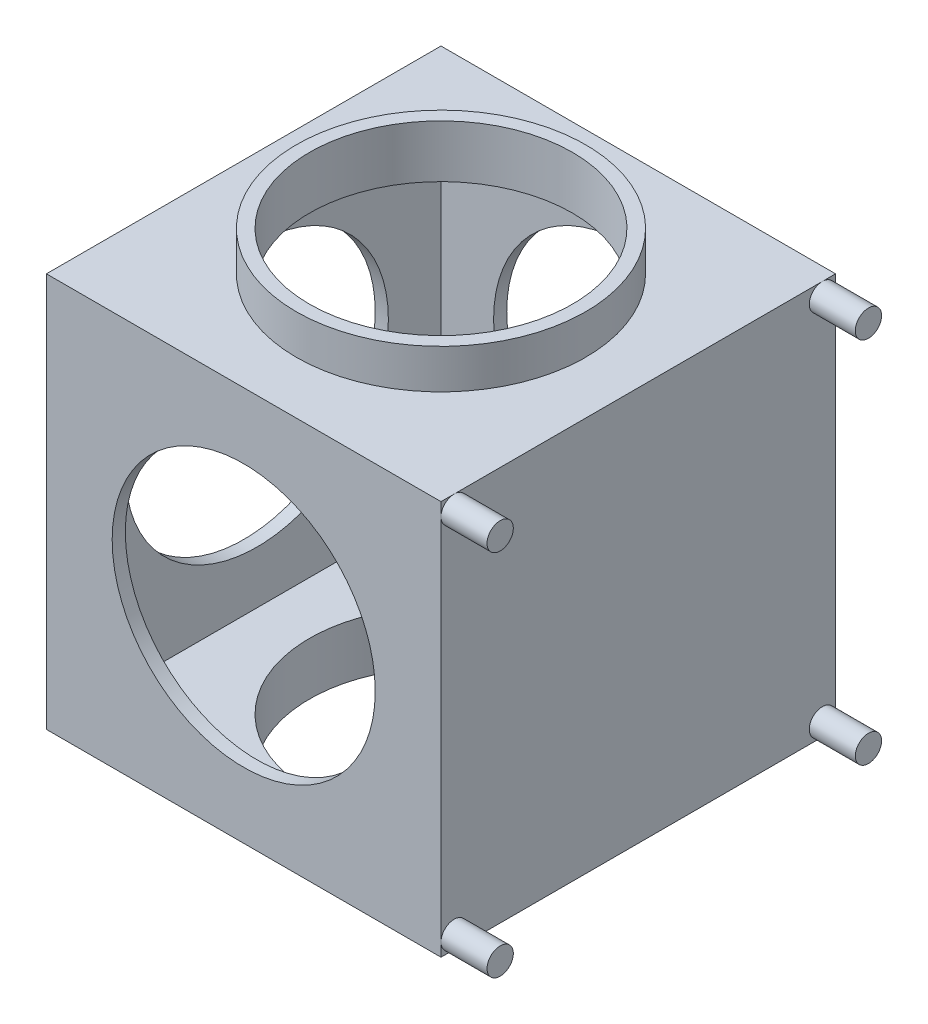
ISO-10303-21;
HEADER;
FILE_DESCRIPTION(('STEP AP214'),'2;1');
FILE_NAME('part.step','',(''),(''),'','','');
FILE_SCHEMA(('AUTOMOTIVE_DESIGN { 1 0 10303 214 1 1 1 1 }'));
ENDSEC;
DATA;
#1=APPLICATION_CONTEXT('core data for automotive mechanical design processes');
#2=APPLICATION_PROTOCOL_DEFINITION('international standard','automotive_design',2000,#1);
#3=PRODUCT_CONTEXT('',#1,'mechanical');
#4=PRODUCT('Part','Part','',(#3));
#5=PRODUCT_RELATED_PRODUCT_CATEGORY('part','',(#4));
#6=PRODUCT_DEFINITION_FORMATION('','',#4);
#7=PRODUCT_DEFINITION_CONTEXT('part definition',#1,'design');
#8=PRODUCT_DEFINITION('design','',#6,#7);
#9=PRODUCT_DEFINITION_SHAPE('','',#8);
#10=(LENGTH_UNIT() NAMED_UNIT(*) SI_UNIT(.MILLI.,.METRE.));
#11=(NAMED_UNIT(*) PLANE_ANGLE_UNIT() SI_UNIT($,.RADIAN.));
#12=(NAMED_UNIT(*) SI_UNIT($,.STERADIAN.) SOLID_ANGLE_UNIT());
#13=UNCERTAINTY_MEASURE_WITH_UNIT(LENGTH_MEASURE(1.E-05),#10,'distance_accuracy_value','');
#14=(GEOMETRIC_REPRESENTATION_CONTEXT(3) GLOBAL_UNCERTAINTY_ASSIGNED_CONTEXT((#13)) GLOBAL_UNIT_ASSIGNED_CONTEXT((#10,
#11,#12)) REPRESENTATION_CONTEXT('',''));
#15=CARTESIAN_POINT('',(0.,0.,0.));
#16=DIRECTION('',(0.,0.,1.));
#17=DIRECTION('',(1.,0.,0.));
#18=AXIS2_PLACEMENT_3D('',#15,#16,#17);
#19=CARTESIAN_POINT('',(0.,0.,0.));
#20=DIRECTION('',(0.,1.,0.));
#21=DIRECTION('',(0.,0.,1.));
#22=AXIS2_PLACEMENT_3D('',#19,#20,#21);
#23=PLANE('',#22);
#24=DIRECTION('',(0.,0.,-1.));
#25=VECTOR('',#24,1.);
#26=CARTESIAN_POINT('',(150.,0.,-150.));
#27=LINE('',#26,#25);
#28=CARTESIAN_POINT('',(150.,0.,150.));
#29=VERTEX_POINT('',#28);
#30=CARTESIAN_POINT('',(150.,0.,140.));
#31=VERTEX_POINT('',#30);
#32=EDGE_CURVE('E158',#29,#31,#27,.T.);
#33=ORIENTED_EDGE('',*,*,#32,.F.);
#34=DIRECTION('',(1.,0.,0.));
#35=VECTOR('',#34,1.);
#36=CARTESIAN_POINT('',(-150.,0.,150.));
#37=LINE('',#36,#35);
#38=CARTESIAN_POINT('',(-150.,0.,150.));
#39=VERTEX_POINT('',#38);
#40=EDGE_CURVE('E150',#39,#29,#37,.T.);
#41=ORIENTED_EDGE('',*,*,#40,.F.);
#42=DIRECTION('',(0.,0.,1.));
#43=VECTOR('',#42,1.);
#44=CARTESIAN_POINT('',(-150.,0.,-150.));
#45=LINE('',#44,#43);
#46=CARTESIAN_POINT('',(-150.,0.,-150.));
#47=VERTEX_POINT('',#46);
#48=EDGE_CURVE('E258',#47,#39,#45,.T.);
#49=ORIENTED_EDGE('',*,*,#48,.F.);
#50=DIRECTION('',(-1.,0.,0.));
#51=VECTOR('',#50,1.);
#52=CARTESIAN_POINT('',(-150.,0.,-150.));
#53=LINE('',#52,#51);
#54=CARTESIAN_POINT('',(150.,0.,-150.));
#55=VERTEX_POINT('',#54);
#56=EDGE_CURVE('E254',#55,#47,#53,.T.);
#57=ORIENTED_EDGE('',*,*,#56,.F.);
#58=CARTESIAN_POINT('',(150.,0.,-139.999999999999));
#59=VERTEX_POINT('',#58);
#60=EDGE_CURVE('E234',#59,#55,#27,.T.);
#61=ORIENTED_EDGE('',*,*,#60,.F.);
#62=EDGE_CURVE('E255',#31,#59,#27,.T.);
#63=ORIENTED_EDGE('',*,*,#62,.F.);
#64=EDGE_LOOP('',(#33,#41,#49,#57,#61,#63));
#65=FACE_BOUND('',#64,.T.);
#66=CARTESIAN_POINT('',(0.,0.,0.));
#67=DIRECTION('',(0.,1.,0.));
#68=DIRECTION('',(0.,0.,1.));
#69=AXIS2_PLACEMENT_3D('',#66,#67,#68);
#70=CIRCLE('',#69,110.);
#71=CARTESIAN_POINT('',(0.,0.,110.));
#72=VERTEX_POINT('',#71);
#73=EDGE_CURVE('E13',#72,#72,#70,.F.);
#74=ORIENTED_EDGE('',*,*,#73,.F.);
#75=EDGE_LOOP('',(#74));
#76=FACE_BOUND('',#75,.T.);
#77=ADVANCED_FACE('F47',(#65,#76),#23,.F.);
#78=CARTESIAN_POINT('',(0.,300.,0.));
#79=DIRECTION('',(0.,1.,0.));
#80=DIRECTION('',(0.,0.,1.));
#81=AXIS2_PLACEMENT_3D('',#78,#79,#80);
#82=PLANE('',#81);
#83=DIRECTION('',(0.,0.,-1.));
#84=VECTOR('',#83,1.);
#85=CARTESIAN_POINT('',(150.,300.,-150.));
#86=LINE('',#85,#84);
#87=CARTESIAN_POINT('',(150.,300.,150.));
#88=VERTEX_POINT('',#87);
#89=CARTESIAN_POINT('',(150.,300.,140.));
#90=VERTEX_POINT('',#89);
#91=EDGE_CURVE('E243',#88,#90,#86,.T.);
#92=ORIENTED_EDGE('',*,*,#91,.T.);
#93=CARTESIAN_POINT('',(150.,300.,-140.000000000001));
#94=VERTEX_POINT('',#93);
#95=EDGE_CURVE('E247',#90,#94,#86,.T.);
#96=ORIENTED_EDGE('',*,*,#95,.T.);
#97=CARTESIAN_POINT('',(150.,300.,-150.));
#98=VERTEX_POINT('',#97);
#99=EDGE_CURVE('E248',#94,#98,#86,.T.);
#100=ORIENTED_EDGE('',*,*,#99,.T.);
#101=DIRECTION('',(-1.,0.,0.));
#102=VECTOR('',#101,1.);
#103=CARTESIAN_POINT('',(-150.,300.,-150.));
#104=LINE('',#103,#102);
#105=CARTESIAN_POINT('',(-150.,300.,-150.));
#106=VERTEX_POINT('',#105);
#107=EDGE_CURVE('E246',#98,#106,#104,.T.);
#108=ORIENTED_EDGE('',*,*,#107,.T.);
#109=DIRECTION('',(0.,0.,1.));
#110=VECTOR('',#109,1.);
#111=CARTESIAN_POINT('',(-150.,300.,-150.));
#112=LINE('',#111,#110);
#113=CARTESIAN_POINT('',(-150.,300.,150.));
#114=VERTEX_POINT('',#113);
#115=EDGE_CURVE('E250',#106,#114,#112,.T.);
#116=ORIENTED_EDGE('',*,*,#115,.T.);
#117=DIRECTION('',(1.,0.,0.));
#118=VECTOR('',#117,1.);
#119=CARTESIAN_POINT('',(-150.,300.,150.));
#120=LINE('',#119,#118);
#121=EDGE_CURVE('E154',#114,#88,#120,.T.);
#122=ORIENTED_EDGE('',*,*,#121,.T.);
#123=EDGE_LOOP('',(#92,#96,#100,#108,#116,#122));
#124=FACE_BOUND('',#123,.T.);
#125=CARTESIAN_POINT('',(0.,300.,0.));
#126=DIRECTION('',(0.,1.,0.));
#127=DIRECTION('',(0.,0.,1.));
#128=AXIS2_PLACEMENT_3D('',#125,#126,#127);
#129=CIRCLE('',#128,110.);
#130=CARTESIAN_POINT('',(0.,300.,110.));
#131=VERTEX_POINT('',#130);
#132=EDGE_CURVE('E165',#131,#131,#129,.T.);
#133=ORIENTED_EDGE('',*,*,#132,.F.);
#134=EDGE_LOOP('',(#133));
#135=FACE_BOUND('',#134,.T.);
#136=ADVANCED_FACE('F310',(#124,#135),#82,.T.);
#137=CARTESIAN_POINT('',(150.,300.,-150.));
#138=DIRECTION('',(-1.,0.,0.));
#139=DIRECTION('',(0.,0.,1.));
#140=AXIS2_PLACEMENT_3D('',#137,#138,#139);
#141=PLANE('',#140);
#142=CARTESIAN_POINT('',(150.,10.,140.));
#143=DIRECTION('',(1.,0.,0.));
#144=DIRECTION('',(0.,0.,-1.));
#145=AXIS2_PLACEMENT_3D('',#142,#143,#144);
#146=CIRCLE('',#145,10.);
#147=CARTESIAN_POINT('',(150.,10.,150.));
#148=VERTEX_POINT('',#147);
#149=EDGE_CURVE('E156',#148,#31,#146,.T.);
#150=ORIENTED_EDGE('',*,*,#149,.F.);
#151=DIRECTION('',(0.,-1.,0.));
#152=VECTOR('',#151,1.);
#153=CARTESIAN_POINT('',(150.,300.,150.));
#154=LINE('',#153,#152);
#155=EDGE_CURVE('E144',#148,#29,#154,.T.);
#156=ORIENTED_EDGE('',*,*,#155,.T.);
#157=ORIENTED_EDGE('',*,*,#32,.T.);
#158=EDGE_LOOP('',(#150,#156,#157));
#159=FACE_BOUND('',#158,.T.);
#160=ADVANCED_FACE('F157',(#159),#141,.F.);
#161=EDGE_CURVE('E62',#31,#148,#146,.T.);
#162=ORIENTED_EDGE('',*,*,#161,.F.);
#163=ORIENTED_EDGE('',*,*,#62,.T.);
#164=CARTESIAN_POINT('',(150.,9.99999999999851,-139.999999999999));
#165=DIRECTION('',(1.,0.,0.));
#166=DIRECTION('',(0.,0.,-1.));
#167=AXIS2_PLACEMENT_3D('',#164,#165,#166);
#168=CIRCLE('',#167,10.);
#169=CARTESIAN_POINT('',(150.,9.99999999999851,-150.));
#170=VERTEX_POINT('',#169);
#171=EDGE_CURVE('E179',#170,#59,#168,.T.);
#172=ORIENTED_EDGE('',*,*,#171,.F.);
#173=DIRECTION('',(0.,-1.,0.));
#174=VECTOR('',#173,1.);
#175=CARTESIAN_POINT('',(150.,300.,-150.));
#176=LINE('',#175,#174);
#177=CARTESIAN_POINT('',(150.,289.999999999999,-150.000000000001));
#178=VERTEX_POINT('',#177);
#179=EDGE_CURVE('E270',#178,#170,#176,.T.);
#180=ORIENTED_EDGE('',*,*,#179,.F.);
#181=CARTESIAN_POINT('',(150.,289.999999999999,-140.000000000001));
#182=DIRECTION('',(1.,0.,0.));
#183=DIRECTION('',(0.,0.,-1.));
#184=AXIS2_PLACEMENT_3D('',#181,#182,#183);
#185=CIRCLE('',#184,10.);
#186=EDGE_CURVE('E55',#94,#178,#185,.T.);
#187=ORIENTED_EDGE('',*,*,#186,.F.);
#188=ORIENTED_EDGE('',*,*,#95,.F.);
#189=CARTESIAN_POINT('',(150.,290.,140.));
#190=DIRECTION('',(1.,0.,0.));
#191=DIRECTION('',(0.,0.,-1.));
#192=AXIS2_PLACEMENT_3D('',#189,#190,#191);
#193=CIRCLE('',#192,10.);
#194=CARTESIAN_POINT('',(150.,290.,150.));
#195=VERTEX_POINT('',#194);
#196=EDGE_CURVE('E140',#195,#90,#193,.T.);
#197=ORIENTED_EDGE('',*,*,#196,.F.);
#198=EDGE_CURVE('E136',#195,#148,#154,.T.);
#199=ORIENTED_EDGE('',*,*,#198,.T.);
#200=EDGE_LOOP('',(#162,#163,#172,#180,#187,#188,#197,#199));
#201=FACE_BOUND('',#200,.T.);
#202=ADVANCED_FACE('F138',(#201),#141,.F.);
#203=EDGE_CURVE('E173',#59,#170,#168,.T.);
#204=ORIENTED_EDGE('',*,*,#203,.F.);
#205=ORIENTED_EDGE('',*,*,#60,.T.);
#206=EDGE_CURVE('E266',#170,#55,#176,.T.);
#207=ORIENTED_EDGE('',*,*,#206,.F.);
#208=EDGE_LOOP('',(#204,#205,#207));
#209=FACE_BOUND('',#208,.T.);
#210=ADVANCED_FACE('F363',(#209),#141,.F.);
#211=EDGE_CURVE('E178',#178,#94,#185,.T.);
#212=ORIENTED_EDGE('',*,*,#211,.F.);
#213=EDGE_CURVE('E267',#98,#178,#176,.T.);
#214=ORIENTED_EDGE('',*,*,#213,.F.);
#215=ORIENTED_EDGE('',*,*,#99,.F.);
#216=EDGE_LOOP('',(#212,#214,#215));
#217=FACE_BOUND('',#216,.T.);
#218=ADVANCED_FACE('F305',(#217),#141,.F.);
#219=CARTESIAN_POINT('',(0.,10.,0.));
#220=DIRECTION('',(0.,1.,0.));
#221=DIRECTION('',(0.,0.,1.));
#222=AXIS2_PLACEMENT_3D('',#219,#220,#221);
#223=PLANE('',#222);
#224=CARTESIAN_POINT('',(0.,10.,0.));
#225=DIRECTION('',(0.,1.,0.));
#226=DIRECTION('',(0.,0.,1.));
#227=AXIS2_PLACEMENT_3D('',#224,#225,#226);
#228=CIRCLE('',#227,100.);
#229=CARTESIAN_POINT('',(0.,10.,100.));
#230=VERTEX_POINT('',#229);
#231=EDGE_CURVE('E206',#230,#230,#228,.T.);
#232=ORIENTED_EDGE('',*,*,#231,.F.);
#233=EDGE_LOOP('',(#232));
#234=FACE_BOUND('',#233,.T.);
#235=DIRECTION('',(0.,0.,-1.));
#236=VECTOR('',#235,1.);
#237=CARTESIAN_POINT('',(140.,10.,-140.));
#238=LINE('',#237,#236);
#239=CARTESIAN_POINT('',(140.,10.,140.));
#240=VERTEX_POINT('',#239);
#241=CARTESIAN_POINT('',(140.,10.,-140.));
#242=VERTEX_POINT('',#241);
#243=EDGE_CURVE('E218',#240,#242,#238,.T.);
#244=ORIENTED_EDGE('',*,*,#243,.T.);
#245=DIRECTION('',(-1.,0.,0.));
#246=VECTOR('',#245,1.);
#247=CARTESIAN_POINT('',(-140.,10.,-140.));
#248=LINE('',#247,#246);
#249=CARTESIAN_POINT('',(-140.,10.,-140.));
#250=VERTEX_POINT('',#249);
#251=EDGE_CURVE('E221',#242,#250,#248,.T.);
#252=ORIENTED_EDGE('',*,*,#251,.T.);
#253=DIRECTION('',(0.,0.,1.));
#254=VECTOR('',#253,1.);
#255=CARTESIAN_POINT('',(-140.,10.,-140.));
#256=LINE('',#255,#254);
#257=CARTESIAN_POINT('',(-140.,10.,140.));
#258=VERTEX_POINT('',#257);
#259=EDGE_CURVE('E224',#250,#258,#256,.T.);
#260=ORIENTED_EDGE('',*,*,#259,.T.);
#261=DIRECTION('',(1.,0.,0.));
#262=VECTOR('',#261,1.);
#263=CARTESIAN_POINT('',(-140.,10.,140.));
#264=LINE('',#263,#262);
#265=EDGE_CURVE('E227',#258,#240,#264,.T.);
#266=ORIENTED_EDGE('',*,*,#265,.T.);
#267=EDGE_LOOP('',(#244,#252,#260,#266));
#268=FACE_BOUND('',#267,.T.);
#269=ADVANCED_FACE('F290',(#234,#268),#223,.T.);
#270=CARTESIAN_POINT('',(-140.,10.,-140.));
#271=DIRECTION('',(0.,0.,-1.));
#272=DIRECTION('',(-1.,0.,0.));
#273=AXIS2_PLACEMENT_3D('',#270,#271,#272);
#274=PLANE('',#273);
#275=CARTESIAN_POINT('',(0.,150.,-140.));
#276=DIRECTION('',(0.,0.,-1.));
#277=DIRECTION('',(-1.,0.,0.));
#278=AXIS2_PLACEMENT_3D('',#275,#276,#277);
#279=CIRCLE('',#278,100.);
#280=CARTESIAN_POINT('',(-100.,150.,-140.));
#281=VERTEX_POINT('',#280);
#282=EDGE_CURVE('E202',#281,#281,#279,.T.);
#283=ORIENTED_EDGE('',*,*,#282,.T.);
#284=EDGE_LOOP('',(#283));
#285=FACE_BOUND('',#284,.T.);
#286=DIRECTION('',(0.,1.,0.));
#287=VECTOR('',#286,1.);
#288=CARTESIAN_POINT('',(140.,10.,-140.));
#289=LINE('',#288,#287);
#290=CARTESIAN_POINT('',(140.,290.,-140.));
#291=VERTEX_POINT('',#290);
#292=EDGE_CURVE('E230',#242,#291,#289,.T.);
#293=ORIENTED_EDGE('',*,*,#292,.T.);
#294=DIRECTION('',(-1.,0.,0.));
#295=VECTOR('',#294,1.);
#296=CARTESIAN_POINT('',(-140.,290.,-140.));
#297=LINE('',#296,#295);
#298=CARTESIAN_POINT('',(-140.,290.,-140.));
#299=VERTEX_POINT('',#298);
#300=EDGE_CURVE('E269',#291,#299,#297,.T.);
#301=ORIENTED_EDGE('',*,*,#300,.T.);
#302=DIRECTION('',(0.,1.,0.));
#303=VECTOR('',#302,1.);
#304=CARTESIAN_POINT('',(-140.,10.,-140.));
#305=LINE('',#304,#303);
#306=EDGE_CURVE('E238',#250,#299,#305,.T.);
#307=ORIENTED_EDGE('',*,*,#306,.F.);
#308=ORIENTED_EDGE('',*,*,#251,.F.);
#309=EDGE_LOOP('',(#293,#301,#307,#308));
#310=FACE_BOUND('',#309,.T.);
#311=ADVANCED_FACE('F295',(#285,#310),#274,.F.);
#312=CARTESIAN_POINT('',(-140.,10.,-140.));
#313=DIRECTION('',(-1.,0.,0.));
#314=DIRECTION('',(0.,0.,1.));
#315=AXIS2_PLACEMENT_3D('',#312,#313,#314);
#316=PLANE('',#315);
#317=CARTESIAN_POINT('',(-140.,150.,0.));
#318=DIRECTION('',(-1.,0.,0.));
#319=DIRECTION('',(0.,0.,1.));
#320=AXIS2_PLACEMENT_3D('',#317,#318,#319);
#321=CIRCLE('',#320,100.);
#322=CARTESIAN_POINT('',(-140.,150.,100.));
#323=VERTEX_POINT('',#322);
#324=EDGE_CURVE('E188',#323,#323,#321,.T.);
#325=ORIENTED_EDGE('',*,*,#324,.T.);
#326=EDGE_LOOP('',(#325));
#327=FACE_BOUND('',#326,.T.);
#328=ORIENTED_EDGE('',*,*,#306,.T.);
#329=DIRECTION('',(0.,0.,1.));
#330=VECTOR('',#329,1.);
#331=CARTESIAN_POINT('',(-140.,290.,-140.));
#332=LINE('',#331,#330);
#333=CARTESIAN_POINT('',(-140.,290.,140.));
#334=VERTEX_POINT('',#333);
#335=EDGE_CURVE('E209',#299,#334,#332,.T.);
#336=ORIENTED_EDGE('',*,*,#335,.T.);
#337=DIRECTION('',(0.,1.,0.));
#338=VECTOR('',#337,1.);
#339=CARTESIAN_POINT('',(-140.,10.,140.));
#340=LINE('',#339,#338);
#341=EDGE_CURVE('E235',#258,#334,#340,.T.);
#342=ORIENTED_EDGE('',*,*,#341,.F.);
#343=ORIENTED_EDGE('',*,*,#259,.F.);
#344=EDGE_LOOP('',(#328,#336,#342,#343));
#345=FACE_BOUND('',#344,.T.);
#346=ADVANCED_FACE('F293',(#327,#345),#316,.F.);
#347=CARTESIAN_POINT('',(-140.,10.,140.));
#348=DIRECTION('',(0.,0.,1.));
#349=DIRECTION('',(1.,0.,0.));
#350=AXIS2_PLACEMENT_3D('',#347,#348,#349);
#351=PLANE('',#350);
#352=CARTESIAN_POINT('',(0.,150.,140.));
#353=DIRECTION('',(0.,0.,1.));
#354=DIRECTION('',(1.,0.,0.));
#355=AXIS2_PLACEMENT_3D('',#352,#353,#354);
#356=CIRCLE('',#355,100.);
#357=CARTESIAN_POINT('',(100.,150.,140.));
#358=VERTEX_POINT('',#357);
#359=EDGE_CURVE('E197',#358,#358,#356,.T.);
#360=ORIENTED_EDGE('',*,*,#359,.T.);
#361=EDGE_LOOP('',(#360));
#362=FACE_BOUND('',#361,.T.);
#363=ORIENTED_EDGE('',*,*,#341,.T.);
#364=DIRECTION('',(1.,0.,0.));
#365=VECTOR('',#364,1.);
#366=CARTESIAN_POINT('',(-140.,290.,140.));
#367=LINE('',#366,#365);
#368=CARTESIAN_POINT('',(140.,290.,140.));
#369=VERTEX_POINT('',#368);
#370=EDGE_CURVE('E212',#334,#369,#367,.T.);
#371=ORIENTED_EDGE('',*,*,#370,.T.);
#372=DIRECTION('',(0.,1.,0.));
#373=VECTOR('',#372,1.);
#374=CARTESIAN_POINT('',(140.,10.,140.));
#375=LINE('',#374,#373);
#376=EDGE_CURVE('E231',#240,#369,#375,.T.);
#377=ORIENTED_EDGE('',*,*,#376,.F.);
#378=ORIENTED_EDGE('',*,*,#265,.F.);
#379=EDGE_LOOP('',(#363,#371,#377,#378));
#380=FACE_BOUND('',#379,.T.);
#381=ADVANCED_FACE('F285',(#362,#380),#351,.F.);
#382=CARTESIAN_POINT('',(140.,10.,-140.));
#383=DIRECTION('',(1.,0.,0.));
#384=DIRECTION('',(0.,0.,-1.));
#385=AXIS2_PLACEMENT_3D('',#382,#383,#384);
#386=PLANE('',#385);
#387=ORIENTED_EDGE('',*,*,#376,.T.);
#388=DIRECTION('',(0.,0.,-1.));
#389=VECTOR('',#388,1.);
#390=CARTESIAN_POINT('',(140.,290.,-140.));
#391=LINE('',#390,#389);
#392=EDGE_CURVE('E215',#369,#291,#391,.T.);
#393=ORIENTED_EDGE('',*,*,#392,.T.);
#394=ORIENTED_EDGE('',*,*,#292,.F.);
#395=ORIENTED_EDGE('',*,*,#243,.F.);
#396=EDGE_LOOP('',(#387,#393,#394,#395));
#397=FACE_BOUND('',#396,.T.);
#398=ADVANCED_FACE('F281',(#397),#386,.F.);
#399=CARTESIAN_POINT('',(0.,290.,0.));
#400=DIRECTION('',(0.,-1.,0.));
#401=DIRECTION('',(0.,0.,-1.));
#402=AXIS2_PLACEMENT_3D('',#399,#400,#401);
#403=PLANE('',#402);
#404=CARTESIAN_POINT('',(0.,290.,0.));
#405=DIRECTION('',(0.,-1.,0.));
#406=DIRECTION('',(0.,0.,-1.));
#407=AXIS2_PLACEMENT_3D('',#404,#405,#406);
#408=CIRCLE('',#407,100.);
#409=CARTESIAN_POINT('',(0.,290.,-100.));
#410=VERTEX_POINT('',#409);
#411=EDGE_CURVE('E205',#410,#410,#408,.T.);
#412=ORIENTED_EDGE('',*,*,#411,.F.);
#413=EDGE_LOOP('',(#412));
#414=FACE_BOUND('',#413,.T.);
#415=ORIENTED_EDGE('',*,*,#392,.F.);
#416=ORIENTED_EDGE('',*,*,#370,.F.);
#417=ORIENTED_EDGE('',*,*,#335,.F.);
#418=ORIENTED_EDGE('',*,*,#300,.F.);
#419=EDGE_LOOP('',(#415,#416,#417,#418));
#420=FACE_BOUND('',#419,.T.);
#421=ADVANCED_FACE('F278',(#414,#420),#403,.T.);
#422=CARTESIAN_POINT('',(0.,0.,0.));
#423=DIRECTION('',(0.,1.,0.));
#424=DIRECTION('',(0.,0.,1.));
#425=AXIS2_PLACEMENT_3D('',#422,#423,#424);
#426=CYLINDRICAL_SURFACE('',#425,100.);
#427=ORIENTED_EDGE('',*,*,#411,.T.);
#428=EDGE_LOOP('',(#427));
#429=FACE_BOUND('',#428,.T.);
#430=CARTESIAN_POINT('',(0.,330.,0.));
#431=DIRECTION('',(0.,1.,0.));
#432=DIRECTION('',(0.,0.,1.));
#433=AXIS2_PLACEMENT_3D('',#430,#431,#432);
#434=CIRCLE('',#433,100.);
#435=CARTESIAN_POINT('',(0.,330.,100.));
#436=VERTEX_POINT('',#435);
#437=EDGE_CURVE('E654',#436,#436,#434,.T.);
#438=ORIENTED_EDGE('',*,*,#437,.T.);
#439=EDGE_LOOP('',(#438));
#440=FACE_BOUND('',#439,.T.);
#441=ADVANCED_FACE('F275',(#429,#440),#426,.F.);
#442=ORIENTED_EDGE('',*,*,#231,.T.);
#443=EDGE_LOOP('',(#442));
#444=FACE_BOUND('',#443,.T.);
#445=CARTESIAN_POINT('',(0.,-30.,0.));
#446=DIRECTION('',(0.,-1.,0.));
#447=DIRECTION('',(0.,0.,-1.));
#448=AXIS2_PLACEMENT_3D('',#445,#446,#447);
#449=CIRCLE('',#448,100.);
#450=CARTESIAN_POINT('',(0.,-30.,-100.));
#451=VERTEX_POINT('',#450);
#452=EDGE_CURVE('E655',#451,#451,#449,.T.);
#453=ORIENTED_EDGE('',*,*,#452,.T.);
#454=EDGE_LOOP('',(#453));
#455=FACE_BOUND('',#454,.T.);
#456=ADVANCED_FACE('F333',(#444,#455),#426,.F.);
#457=EDGE_CURVE('E70',#90,#195,#193,.T.);
#458=ORIENTED_EDGE('',*,*,#457,.F.);
#459=ORIENTED_EDGE('',*,*,#91,.F.);
#460=EDGE_CURVE('E143',#88,#195,#154,.T.);
#461=ORIENTED_EDGE('',*,*,#460,.T.);
#462=EDGE_LOOP('',(#458,#459,#461));
#463=FACE_BOUND('',#462,.T.);
#464=ADVANCED_FACE('F49',(#463),#141,.F.);
#465=CARTESIAN_POINT('',(-150.,300.,-150.));
#466=DIRECTION('',(0.,0.,1.));
#467=DIRECTION('',(1.,0.,0.));
#468=AXIS2_PLACEMENT_3D('',#465,#466,#467);
#469=PLANE('',#468);
#470=CARTESIAN_POINT('',(0.,150.,-150.));
#471=DIRECTION('',(0.,0.,-1.));
#472=DIRECTION('',(-1.,0.,0.));
#473=AXIS2_PLACEMENT_3D('',#470,#471,#472);
#474=CIRCLE('',#473,100.);
#475=CARTESIAN_POINT('',(-100.,150.,-150.));
#476=VERTEX_POINT('',#475);
#477=EDGE_CURVE('E191',#476,#476,#474,.T.);
#478=ORIENTED_EDGE('',*,*,#477,.F.);
#479=EDGE_LOOP('',(#478));
#480=FACE_BOUND('',#479,.T.);
#481=ORIENTED_EDGE('',*,*,#56,.T.);
#482=DIRECTION('',(0.,-1.,0.));
#483=VECTOR('',#482,1.);
#484=CARTESIAN_POINT('',(-150.,300.,-150.));
#485=LINE('',#484,#483);
#486=EDGE_CURVE('E264',#106,#47,#485,.T.);
#487=ORIENTED_EDGE('',*,*,#486,.F.);
#488=ORIENTED_EDGE('',*,*,#107,.F.);
#489=ORIENTED_EDGE('',*,*,#213,.T.);
#490=ORIENTED_EDGE('',*,*,#179,.T.);
#491=ORIENTED_EDGE('',*,*,#206,.T.);
#492=EDGE_LOOP('',(#481,#487,#488,#489,#490,#491));
#493=FACE_BOUND('',#492,.T.);
#494=ADVANCED_FACE('F326',(#480,#493),#469,.F.);
#495=CARTESIAN_POINT('',(-150.,300.,-150.));
#496=DIRECTION('',(1.,0.,0.));
#497=DIRECTION('',(0.,0.,-1.));
#498=AXIS2_PLACEMENT_3D('',#495,#496,#497);
#499=PLANE('',#498);
#500=CARTESIAN_POINT('',(-150.,150.,0.));
#501=DIRECTION('',(-1.,0.,0.));
#502=DIRECTION('',(0.,0.,1.));
#503=AXIS2_PLACEMENT_3D('',#500,#501,#502);
#504=CIRCLE('',#503,100.);
#505=CARTESIAN_POINT('',(-150.,150.,100.));
#506=VERTEX_POINT('',#505);
#507=EDGE_CURVE('E185',#506,#506,#504,.T.);
#508=ORIENTED_EDGE('',*,*,#507,.F.);
#509=EDGE_LOOP('',(#508));
#510=FACE_BOUND('',#509,.T.);
#511=ORIENTED_EDGE('',*,*,#48,.T.);
#512=DIRECTION('',(0.,-1.,0.));
#513=VECTOR('',#512,1.);
#514=CARTESIAN_POINT('',(-150.,300.,150.));
#515=LINE('',#514,#513);
#516=EDGE_CURVE('E262',#114,#39,#515,.T.);
#517=ORIENTED_EDGE('',*,*,#516,.F.);
#518=ORIENTED_EDGE('',*,*,#115,.F.);
#519=ORIENTED_EDGE('',*,*,#486,.T.);
#520=EDGE_LOOP('',(#511,#517,#518,#519));
#521=FACE_BOUND('',#520,.T.);
#522=ADVANCED_FACE('F323',(#510,#521),#499,.F.);
#523=CARTESIAN_POINT('',(-150.,300.,150.));
#524=DIRECTION('',(0.,0.,-1.));
#525=DIRECTION('',(-1.,0.,0.));
#526=AXIS2_PLACEMENT_3D('',#523,#524,#525);
#527=PLANE('',#526);
#528=CARTESIAN_POINT('',(0.,150.,150.));
#529=DIRECTION('',(0.,0.,-1.));
#530=DIRECTION('',(-1.,0.,0.));
#531=AXIS2_PLACEMENT_3D('',#528,#529,#530);
#532=CIRCLE('',#531,100.);
#533=CARTESIAN_POINT('',(-100.,150.,150.));
#534=VERTEX_POINT('',#533);
#535=EDGE_CURVE('E194',#534,#534,#532,.T.);
#536=ORIENTED_EDGE('',*,*,#535,.T.);
#537=EDGE_LOOP('',(#536));
#538=FACE_BOUND('',#537,.T.);
#539=ORIENTED_EDGE('',*,*,#40,.T.);
#540=ORIENTED_EDGE('',*,*,#155,.F.);
#541=ORIENTED_EDGE('',*,*,#198,.F.);
#542=ORIENTED_EDGE('',*,*,#460,.F.);
#543=ORIENTED_EDGE('',*,*,#121,.F.);
#544=ORIENTED_EDGE('',*,*,#516,.T.);
#545=EDGE_LOOP('',(#539,#540,#541,#542,#543,#544));
#546=FACE_BOUND('',#545,.T.);
#547=ADVANCED_FACE('F148',(#538,#546),#527,.F.);
#548=CARTESIAN_POINT('',(0.,150.,150.));
#549=DIRECTION('',(0.,0.,-1.));
#550=DIRECTION('',(-1.,0.,0.));
#551=AXIS2_PLACEMENT_3D('',#548,#549,#550);
#552=CYLINDRICAL_SURFACE('',#551,100.);
#553=ORIENTED_EDGE('',*,*,#535,.F.);
#554=EDGE_LOOP('',(#553));
#555=FACE_BOUND('',#554,.T.);
#556=ORIENTED_EDGE('',*,*,#359,.F.);
#557=EDGE_LOOP('',(#556));
#558=FACE_BOUND('',#557,.T.);
#559=ADVANCED_FACE('F322',(#555,#558),#552,.F.);
#560=ORIENTED_EDGE('',*,*,#477,.T.);
#561=EDGE_LOOP('',(#560));
#562=FACE_BOUND('',#561,.T.);
#563=ORIENTED_EDGE('',*,*,#282,.F.);
#564=EDGE_LOOP('',(#563));
#565=FACE_BOUND('',#564,.T.);
#566=ADVANCED_FACE('F485',(#562,#565),#552,.F.);
#567=CARTESIAN_POINT('',(-140.,150.,0.));
#568=DIRECTION('',(-1.,0.,0.));
#569=DIRECTION('',(0.,0.,1.));
#570=AXIS2_PLACEMENT_3D('',#567,#568,#569);
#571=CYLINDRICAL_SURFACE('',#570,100.);
#572=ORIENTED_EDGE('',*,*,#324,.F.);
#573=EDGE_LOOP('',(#572));
#574=FACE_BOUND('',#573,.T.);
#575=ORIENTED_EDGE('',*,*,#507,.T.);
#576=EDGE_LOOP('',(#575));
#577=FACE_BOUND('',#576,.T.);
#578=ADVANCED_FACE('F481',(#574,#577),#571,.F.);
#579=CARTESIAN_POINT('',(185.,289.999999999999,-140.000000000001));
#580=DIRECTION('',(-1.,0.,0.));
#581=DIRECTION('',(0.,0.,1.));
#582=AXIS2_PLACEMENT_3D('',#579,#580,#581);
#583=CYLINDRICAL_SURFACE('',#582,10.);
#584=CARTESIAN_POINT('',(185.,289.999999999999,-140.000000000001));
#585=DIRECTION('',(1.,0.,0.));
#586=DIRECTION('',(0.,0.,-1.));
#587=AXIS2_PLACEMENT_3D('',#584,#585,#586);
#588=CIRCLE('',#587,10.);
#589=CARTESIAN_POINT('',(185.,289.999999999999,-150.000000000001));
#590=VERTEX_POINT('',#589);
#591=EDGE_CURVE('E182',#590,#590,#588,.T.);
#592=ORIENTED_EDGE('',*,*,#591,.F.);
#593=EDGE_LOOP('',(#592));
#594=FACE_BOUND('',#593,.T.);
#595=ORIENTED_EDGE('',*,*,#211,.T.);
#596=ORIENTED_EDGE('',*,*,#186,.T.);
#597=EDGE_LOOP('',(#595,#596));
#598=FACE_BOUND('',#597,.T.);
#599=ADVANCED_FACE('F357',(#594,#598),#583,.T.);
#600=CARTESIAN_POINT('',(185.,0.,0.));
#601=DIRECTION('',(1.,0.,0.));
#602=DIRECTION('',(0.,0.,-1.));
#603=AXIS2_PLACEMENT_3D('',#600,#601,#602);
#604=PLANE('',#603);
#605=ORIENTED_EDGE('',*,*,#591,.T.);
#606=EDGE_LOOP('',(#605));
#607=FACE_BOUND('',#606,.T.);
#608=ADVANCED_FACE('F474',(#607),#604,.T.);
#609=CARTESIAN_POINT('',(185.,9.99999999999851,-139.999999999999));
#610=DIRECTION('',(-1.,0.,0.));
#611=DIRECTION('',(0.,0.,1.));
#612=AXIS2_PLACEMENT_3D('',#609,#610,#611);
#613=CYLINDRICAL_SURFACE('',#612,10.);
#614=CARTESIAN_POINT('',(185.,9.99999999999851,-139.999999999999));
#615=DIRECTION('',(1.,0.,0.));
#616=DIRECTION('',(0.,0.,-1.));
#617=AXIS2_PLACEMENT_3D('',#614,#615,#616);
#618=CIRCLE('',#617,10.);
#619=CARTESIAN_POINT('',(185.,9.99999999999851,-149.999999999999));
#620=VERTEX_POINT('',#619);
#621=EDGE_CURVE('E175',#620,#620,#618,.T.);
#622=ORIENTED_EDGE('',*,*,#621,.F.);
#623=EDGE_LOOP('',(#622));
#624=FACE_BOUND('',#623,.T.);
#625=ORIENTED_EDGE('',*,*,#171,.T.);
#626=ORIENTED_EDGE('',*,*,#203,.T.);
#627=EDGE_LOOP('',(#625,#626));
#628=FACE_BOUND('',#627,.T.);
#629=ADVANCED_FACE('F361',(#624,#628),#613,.T.);
#630=CARTESIAN_POINT('',(185.,0.,0.));
#631=DIRECTION('',(1.,0.,0.));
#632=DIRECTION('',(0.,0.,-1.));
#633=AXIS2_PLACEMENT_3D('',#630,#631,#632);
#634=PLANE('',#633);
#635=ORIENTED_EDGE('',*,*,#621,.T.);
#636=EDGE_LOOP('',(#635));
#637=FACE_BOUND('',#636,.T.);
#638=ADVANCED_FACE('F467',(#637),#634,.T.);
#639=CARTESIAN_POINT('',(185.,290.,140.));
#640=DIRECTION('',(-1.,0.,0.));
#641=DIRECTION('',(0.,0.,1.));
#642=AXIS2_PLACEMENT_3D('',#639,#640,#641);
#643=CYLINDRICAL_SURFACE('',#642,10.);
#644=CARTESIAN_POINT('',(185.,290.,140.));
#645=DIRECTION('',(1.,0.,0.));
#646=DIRECTION('',(0.,0.,-1.));
#647=AXIS2_PLACEMENT_3D('',#644,#645,#646);
#648=CIRCLE('',#647,10.);
#649=CARTESIAN_POINT('',(185.,290.,130.));
#650=VERTEX_POINT('',#649);
#651=EDGE_CURVE('E170',#650,#650,#648,.T.);
#652=ORIENTED_EDGE('',*,*,#651,.F.);
#653=EDGE_LOOP('',(#652));
#654=FACE_BOUND('',#653,.T.);
#655=ORIENTED_EDGE('',*,*,#457,.T.);
#656=ORIENTED_EDGE('',*,*,#196,.T.);
#657=EDGE_LOOP('',(#655,#656));
#658=FACE_BOUND('',#657,.T.);
#659=ADVANCED_FACE('F463',(#654,#658),#643,.T.);
#660=CARTESIAN_POINT('',(185.,0.,0.));
#661=DIRECTION('',(1.,0.,0.));
#662=DIRECTION('',(0.,0.,-1.));
#663=AXIS2_PLACEMENT_3D('',#660,#661,#662);
#664=PLANE('',#663);
#665=ORIENTED_EDGE('',*,*,#651,.T.);
#666=EDGE_LOOP('',(#665));
#667=FACE_BOUND('',#666,.T.);
#668=ADVANCED_FACE('F459',(#667),#664,.T.);
#669=CARTESIAN_POINT('',(185.,10.,140.));
#670=DIRECTION('',(-1.,0.,0.));
#671=DIRECTION('',(0.,0.,1.));
#672=AXIS2_PLACEMENT_3D('',#669,#670,#671);
#673=CYLINDRICAL_SURFACE('',#672,10.);
#674=CARTESIAN_POINT('',(185.,10.,140.));
#675=DIRECTION('',(1.,0.,0.));
#676=DIRECTION('',(0.,0.,-1.));
#677=AXIS2_PLACEMENT_3D('',#674,#675,#676);
#678=CIRCLE('',#677,10.);
#679=CARTESIAN_POINT('',(185.,10.,130.));
#680=VERTEX_POINT('',#679);
#681=EDGE_CURVE('E160',#680,#680,#678,.T.);
#682=ORIENTED_EDGE('',*,*,#681,.F.);
#683=EDGE_LOOP('',(#682));
#684=FACE_BOUND('',#683,.T.);
#685=ORIENTED_EDGE('',*,*,#149,.T.);
#686=ORIENTED_EDGE('',*,*,#161,.T.);
#687=EDGE_LOOP('',(#685,#686));
#688=FACE_BOUND('',#687,.T.);
#689=ADVANCED_FACE('F162',(#684,#688),#673,.T.);
#690=CARTESIAN_POINT('',(185.,0.,0.));
#691=DIRECTION('',(1.,0.,0.));
#692=DIRECTION('',(0.,0.,-1.));
#693=AXIS2_PLACEMENT_3D('',#690,#691,#692);
#694=PLANE('',#693);
#695=ORIENTED_EDGE('',*,*,#681,.T.);
#696=EDGE_LOOP('',(#695));
#697=FACE_BOUND('',#696,.T.);
#698=ADVANCED_FACE('F387',(#697),#694,.T.);
#699=CARTESIAN_POINT('',(0.,330.,0.));
#700=DIRECTION('',(0.,1.,0.));
#701=DIRECTION('',(0.,0.,1.));
#702=AXIS2_PLACEMENT_3D('',#699,#700,#701);
#703=PLANE('',#702);
#704=CARTESIAN_POINT('',(0.,330.,0.));
#705=DIRECTION('',(0.,1.,0.));
#706=DIRECTION('',(0.,0.,1.));
#707=AXIS2_PLACEMENT_3D('',#704,#705,#706);
#708=CIRCLE('',#707,110.);
#709=CARTESIAN_POINT('',(0.,330.,110.));
#710=VERTEX_POINT('',#709);
#711=EDGE_CURVE('E163',#710,#710,#708,.T.);
#712=ORIENTED_EDGE('',*,*,#711,.T.);
#713=EDGE_LOOP('',(#712));
#714=FACE_BOUND('',#713,.T.);
#715=ORIENTED_EDGE('',*,*,#437,.F.);
#716=EDGE_LOOP('',(#715));
#717=FACE_BOUND('',#716,.T.);
#718=ADVANCED_FACE('F402',(#714,#717),#703,.T.);
#719=CARTESIAN_POINT('',(0.,330.,0.));
#720=DIRECTION('',(0.,-1.,0.));
#721=DIRECTION('',(0.,0.,-1.));
#722=AXIS2_PLACEMENT_3D('',#719,#720,#721);
#723=CYLINDRICAL_SURFACE('',#722,110.);
#724=ORIENTED_EDGE('',*,*,#711,.F.);
#725=EDGE_LOOP('',(#724));
#726=FACE_BOUND('',#725,.T.);
#727=ORIENTED_EDGE('',*,*,#132,.T.);
#728=EDGE_LOOP('',(#727));
#729=FACE_BOUND('',#728,.T.);
#730=ADVANCED_FACE('F406',(#726,#729),#723,.T.);
#731=CARTESIAN_POINT('',(0.,-30.,0.));
#732=DIRECTION('',(0.,-1.,0.));
#733=DIRECTION('',(0.,0.,-1.));
#734=AXIS2_PLACEMENT_3D('',#731,#732,#733);
#735=PLANE('',#734);
#736=CARTESIAN_POINT('',(0.,-30.,0.));
#737=DIRECTION('',(0.,-1.,0.));
#738=DIRECTION('',(0.,0.,-1.));
#739=AXIS2_PLACEMENT_3D('',#736,#737,#738);
#740=CIRCLE('',#739,110.);
#741=CARTESIAN_POINT('',(0.,-30.,-110.));
#742=VERTEX_POINT('',#741);
#743=EDGE_CURVE('E652',#742,#742,#740,.T.);
#744=ORIENTED_EDGE('',*,*,#743,.T.);
#745=EDGE_LOOP('',(#744));
#746=FACE_BOUND('',#745,.T.);
#747=ORIENTED_EDGE('',*,*,#452,.F.);
#748=EDGE_LOOP('',(#747));
#749=FACE_BOUND('',#748,.T.);
#750=ADVANCED_FACE('F415',(#746,#749),#735,.T.);
#751=CARTESIAN_POINT('',(0.,-30.,0.));
#752=DIRECTION('',(0.,1.,0.));
#753=DIRECTION('',(0.,0.,1.));
#754=AXIS2_PLACEMENT_3D('',#751,#752,#753);
#755=CYLINDRICAL_SURFACE('',#754,110.);
#756=ORIENTED_EDGE('',*,*,#743,.F.);
#757=EDGE_LOOP('',(#756));
#758=FACE_BOUND('',#757,.T.);
#759=ORIENTED_EDGE('',*,*,#73,.T.);
#760=EDGE_LOOP('',(#759));
#761=FACE_BOUND('',#760,.T.);
#762=ADVANCED_FACE('F438',(#758,#761),#755,.T.);
#763=CLOSED_SHELL('',(#77,#136,#160,#202,#210,#218,#269,#311,#346,#381,#398,#421,#441,#456,#464,
#494,#522,#547,#559,#566,#578,#599,#608,#629,#638,#659,#668,#689,#698,#718,#730,#750,#762));
#764=MANIFOLD_SOLID_BREP('B2',#763);
#765=ADVANCED_BREP_SHAPE_REPRESENTATION('',(#18,#764),#14);
#766=SHAPE_DEFINITION_REPRESENTATION(#9,#765);
ENDSEC;
END-ISO-10303-21;
